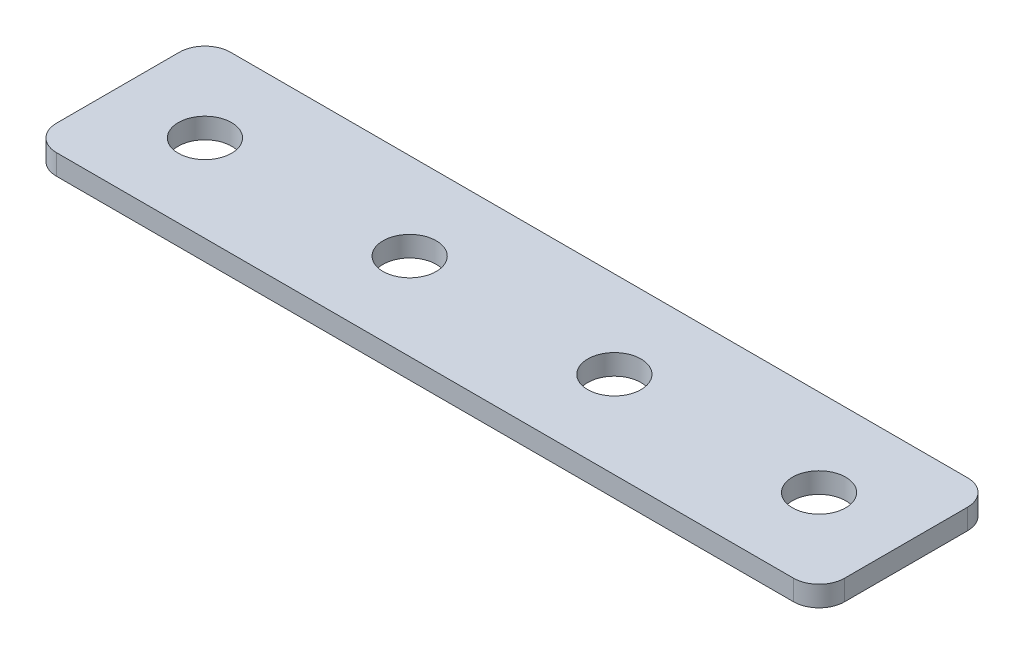
ISO-10303-21;
HEADER;
FILE_DESCRIPTION(('STEP AP214'),'2;1');
FILE_NAME('part.step','',(''),(''),'','','');
FILE_SCHEMA(('AUTOMOTIVE_DESIGN { 1 0 10303 214 1 1 1 1 }'));
ENDSEC;
DATA;
#1=APPLICATION_CONTEXT('core data for automotive mechanical design processes');
#2=APPLICATION_PROTOCOL_DEFINITION('international standard','automotive_design',2000,#1);
#3=PRODUCT_CONTEXT('',#1,'mechanical');
#4=PRODUCT('Part','Part','',(#3));
#5=PRODUCT_RELATED_PRODUCT_CATEGORY('part','',(#4));
#6=PRODUCT_DEFINITION_FORMATION('','',#4);
#7=PRODUCT_DEFINITION_CONTEXT('part definition',#1,'design');
#8=PRODUCT_DEFINITION('design','',#6,#7);
#9=PRODUCT_DEFINITION_SHAPE('','',#8);
#10=(LENGTH_UNIT() NAMED_UNIT(*) SI_UNIT(.MILLI.,.METRE.));
#11=(NAMED_UNIT(*) PLANE_ANGLE_UNIT() SI_UNIT($,.RADIAN.));
#12=(NAMED_UNIT(*) SI_UNIT($,.STERADIAN.) SOLID_ANGLE_UNIT());
#13=UNCERTAINTY_MEASURE_WITH_UNIT(LENGTH_MEASURE(1.E-05),#10,'distance_accuracy_value','');
#14=(GEOMETRIC_REPRESENTATION_CONTEXT(3) GLOBAL_UNCERTAINTY_ASSIGNED_CONTEXT((#13)) GLOBAL_UNIT_ASSIGNED_CONTEXT((#10,
#11,#12)) REPRESENTATION_CONTEXT('',''));
#15=CARTESIAN_POINT('',(0.,0.,0.));
#16=DIRECTION('',(0.,0.,1.));
#17=DIRECTION('',(1.,0.,0.));
#18=AXIS2_PLACEMENT_3D('',#15,#16,#17);
#19=CARTESIAN_POINT('',(-31.9370240083276,1.92462627726309,-0.98712697382552));
#20=DIRECTION('',(0.,-1.,0.));
#21=DIRECTION('',(0.,0.,-1.));
#22=AXIS2_PLACEMENT_3D('',#19,#20,#21);
#23=PLANE('',#22);
#24=CARTESIAN_POINT('',(28.0629759916724,1.92462627726309,-0.98712697382552));
#25=DIRECTION('',(0.,1.,0.));
#26=DIRECTION('',(0.,0.,1.));
#27=AXIS2_PLACEMENT_3D('',#24,#25,#26);
#28=CIRCLE('',#27,2.6);
#29=CARTESIAN_POINT('',(28.0629759916724,1.92462627726309,1.61287302617448));
#30=VERTEX_POINT('',#29);
#31=EDGE_CURVE('E169',#30,#30,#28,.T.);
#32=ORIENTED_EDGE('',*,*,#31,.T.);
#33=EDGE_LOOP('',(#32));
#34=FACE_BOUND('',#33,.T.);
#35=CARTESIAN_POINT('',(8.06297599167245,1.92462627726309,-0.98712697382552));
#36=DIRECTION('',(0.,1.,0.));
#37=DIRECTION('',(0.,0.,1.));
#38=AXIS2_PLACEMENT_3D('',#35,#36,#37);
#39=CIRCLE('',#38,2.6);
#40=CARTESIAN_POINT('',(8.06297599167245,1.92462627726309,1.61287302617448));
#41=VERTEX_POINT('',#40);
#42=EDGE_CURVE('E163',#41,#41,#39,.T.);
#43=ORIENTED_EDGE('',*,*,#42,.T.);
#44=EDGE_LOOP('',(#43));
#45=FACE_BOUND('',#44,.T.);
#46=CARTESIAN_POINT('',(-11.9370240083276,1.92462627726309,-0.987126973825509));
#47=DIRECTION('',(0.,1.,0.));
#48=DIRECTION('',(0.,0.,1.));
#49=AXIS2_PLACEMENT_3D('',#46,#47,#48);
#50=CIRCLE('',#49,2.6);
#51=CARTESIAN_POINT('',(-11.9370240083276,1.92462627726309,1.61287302617449));
#52=VERTEX_POINT('',#51);
#53=EDGE_CURVE('E157',#52,#52,#50,.T.);
#54=ORIENTED_EDGE('',*,*,#53,.T.);
#55=EDGE_LOOP('',(#54));
#56=FACE_BOUND('',#55,.T.);
#57=CARTESIAN_POINT('',(-31.9370240083276,1.92462627726309,-0.98712697382552));
#58=DIRECTION('',(0.,1.,0.));
#59=DIRECTION('',(0.,0.,1.));
#60=AXIS2_PLACEMENT_3D('',#57,#58,#59);
#61=CIRCLE('',#60,2.6);
#62=CARTESIAN_POINT('',(-31.9370240083276,1.92462627726309,1.61287302617448));
#63=VERTEX_POINT('',#62);
#64=EDGE_CURVE('E103',#63,#63,#61,.T.);
#65=ORIENTED_EDGE('',*,*,#64,.T.);
#66=EDGE_LOOP('',(#65));
#67=FACE_BOUND('',#66,.T.);
#68=DIRECTION('',(0.,0.,-1.));
#69=VECTOR('',#68,1.);
#70=CARTESIAN_POINT('',(36.5629759916724,1.92462627726309,7.51287302617452));
#71=LINE('',#70,#69);
#72=CARTESIAN_POINT('',(36.5629759916724,1.92462627726309,5.01287302617452));
#73=VERTEX_POINT('',#72);
#74=CARTESIAN_POINT('',(36.5629759916724,1.92462627726309,-6.98712697382557));
#75=VERTEX_POINT('',#74);
#76=EDGE_CURVE('E150',#73,#75,#71,.T.);
#77=ORIENTED_EDGE('',*,*,#76,.F.);
#78=CARTESIAN_POINT('',(34.0629759916724,1.92462627726309,5.01287302617452));
#79=DIRECTION('',(0.,-1.,0.));
#80=DIRECTION('',(0.,0.,-1.));
#81=AXIS2_PLACEMENT_3D('',#78,#79,#80);
#82=CIRCLE('',#81,2.5);
#83=CARTESIAN_POINT('',(34.0629759916724,1.92462627726309,7.51287302617452));
#84=VERTEX_POINT('',#83);
#85=EDGE_CURVE('E130',#73,#84,#82,.T.);
#86=ORIENTED_EDGE('',*,*,#85,.T.);
#87=DIRECTION('',(1.,0.,0.));
#88=VECTOR('',#87,1.);
#89=CARTESIAN_POINT('',(-23.4370240083275,1.92462627726309,7.51287302617452));
#90=LINE('',#89,#88);
#91=CARTESIAN_POINT('',(-37.9370240083276,1.92462627726309,7.51287302617452));
#92=VERTEX_POINT('',#91);
#93=EDGE_CURVE('E146',#92,#84,#90,.T.);
#94=ORIENTED_EDGE('',*,*,#93,.F.);
#95=CARTESIAN_POINT('',(-37.9370240083276,1.92462627726309,5.01287302617452));
#96=DIRECTION('',(0.,-1.,0.));
#97=DIRECTION('',(0.,0.,-1.));
#98=AXIS2_PLACEMENT_3D('',#95,#96,#97);
#99=CIRCLE('',#98,2.5);
#100=CARTESIAN_POINT('',(-40.4370240083276,1.92462627726309,5.01287302617452));
#101=VERTEX_POINT('',#100);
#102=EDGE_CURVE('E106',#92,#101,#99,.T.);
#103=ORIENTED_EDGE('',*,*,#102,.T.);
#104=DIRECTION('',(0.,0.,1.));
#105=VECTOR('',#104,1.);
#106=CARTESIAN_POINT('',(-40.4370240083276,1.92462627726309,-9.48712697382556));
#107=LINE('',#106,#105);
#108=CARTESIAN_POINT('',(-40.4370240083276,1.92462627726309,-6.98712697382556));
#109=VERTEX_POINT('',#108);
#110=EDGE_CURVE('E107',#109,#101,#107,.T.);
#111=ORIENTED_EDGE('',*,*,#110,.F.);
#112=CARTESIAN_POINT('',(-37.9370240083276,1.92462627726309,-6.98712697382556));
#113=DIRECTION('',(0.,-1.,0.));
#114=DIRECTION('',(0.,0.,-1.));
#115=AXIS2_PLACEMENT_3D('',#112,#113,#114);
#116=CIRCLE('',#115,2.5);
#117=CARTESIAN_POINT('',(-37.9370240083276,1.92462627726309,-9.48712697382556));
#118=VERTEX_POINT('',#117);
#119=EDGE_CURVE('E31',#109,#118,#116,.T.);
#120=ORIENTED_EDGE('',*,*,#119,.T.);
#121=DIRECTION('',(-1.,0.,0.));
#122=VECTOR('',#121,1.);
#123=CARTESIAN_POINT('',(36.5629759916724,1.92462627726309,-9.48712697382557));
#124=LINE('',#123,#122);
#125=CARTESIAN_POINT('',(34.0629759916724,1.92462627726309,-9.48712697382557));
#126=VERTEX_POINT('',#125);
#127=EDGE_CURVE('E111',#126,#118,#124,.T.);
#128=ORIENTED_EDGE('',*,*,#127,.F.);
#129=CARTESIAN_POINT('',(34.0629759916724,1.92462627726309,-6.98712697382557));
#130=DIRECTION('',(0.,-1.,0.));
#131=DIRECTION('',(0.,0.,-1.));
#132=AXIS2_PLACEMENT_3D('',#129,#130,#131);
#133=CIRCLE('',#132,2.5);
#134=EDGE_CURVE('E128',#126,#75,#133,.T.);
#135=ORIENTED_EDGE('',*,*,#134,.T.);
#136=EDGE_LOOP('',(#77,#86,#94,#103,#111,#120,#128,#135));
#137=FACE_BOUND('',#136,.T.);
#138=ADVANCED_FACE('F16',(#34,#45,#56,#67,#137),#23,.T.);
#139=CARTESIAN_POINT('',(-23.4370240083275,1.92462627726309,7.51287302617452));
#140=DIRECTION('',(0.,0.,1.));
#141=DIRECTION('',(1.,0.,0.));
#142=AXIS2_PLACEMENT_3D('',#139,#140,#141);
#143=PLANE('',#142);
#144=ORIENTED_EDGE('',*,*,#93,.T.);
#145=DIRECTION('',(0.,1.,0.));
#146=VECTOR('',#145,1.);
#147=CARTESIAN_POINT('',(34.0629759916724,1.92462627726309,7.51287302617452));
#148=LINE('',#147,#146);
#149=CARTESIAN_POINT('',(34.0629759916724,3.92462627726309,7.51287302617452));
#150=VERTEX_POINT('',#149);
#151=EDGE_CURVE('E93',#84,#150,#148,.T.);
#152=ORIENTED_EDGE('',*,*,#151,.T.);
#153=DIRECTION('',(1.,0.,0.));
#154=VECTOR('',#153,1.);
#155=CARTESIAN_POINT('',(-23.4370240083275,3.92462627726309,7.51287302617452));
#156=LINE('',#155,#154);
#157=CARTESIAN_POINT('',(-37.9370240083276,3.92462627726309,7.51287302617452));
#158=VERTEX_POINT('',#157);
#159=EDGE_CURVE('E85',#158,#150,#156,.T.);
#160=ORIENTED_EDGE('',*,*,#159,.F.);
#161=DIRECTION('',(0.,1.,0.));
#162=VECTOR('',#161,1.);
#163=CARTESIAN_POINT('',(-37.9370240083276,1.92462627726309,7.51287302617452));
#164=LINE('',#163,#162);
#165=EDGE_CURVE('E99',#158,#92,#164,.F.);
#166=ORIENTED_EDGE('',*,*,#165,.T.);
#167=EDGE_LOOP('',(#144,#152,#160,#166));
#168=FACE_BOUND('',#167,.T.);
#169=ADVANCED_FACE('F98',(#168),#143,.T.);
#170=CARTESIAN_POINT('',(-40.4370240083276,1.92462627726309,-9.48712697382556));
#171=DIRECTION('',(-1.,0.,0.));
#172=DIRECTION('',(0.,0.,1.));
#173=AXIS2_PLACEMENT_3D('',#170,#171,#172);
#174=PLANE('',#173);
#175=DIRECTION('',(0.,0.,1.));
#176=VECTOR('',#175,1.);
#177=CARTESIAN_POINT('',(-40.4370240083276,3.92462627726309,-9.48712697382556));
#178=LINE('',#177,#176);
#179=CARTESIAN_POINT('',(-40.4370240083276,3.92462627726309,-6.98712697382556));
#180=VERTEX_POINT('',#179);
#181=CARTESIAN_POINT('',(-40.4370240083276,3.92462627726309,5.01287302617452));
#182=VERTEX_POINT('',#181);
#183=EDGE_CURVE('E87',#180,#182,#178,.T.);
#184=ORIENTED_EDGE('',*,*,#183,.F.);
#185=DIRECTION('',(0.,1.,0.));
#186=VECTOR('',#185,1.);
#187=CARTESIAN_POINT('',(-40.4370240083276,1.92462627726309,-6.98712697382556));
#188=LINE('',#187,#186);
#189=EDGE_CURVE('E10',#180,#109,#188,.F.);
#190=ORIENTED_EDGE('',*,*,#189,.T.);
#191=ORIENTED_EDGE('',*,*,#110,.T.);
#192=DIRECTION('',(0.,1.,0.));
#193=VECTOR('',#192,1.);
#194=CARTESIAN_POINT('',(-40.4370240083276,1.92462627726309,5.01287302617452));
#195=LINE('',#194,#193);
#196=EDGE_CURVE('E24',#101,#182,#195,.T.);
#197=ORIENTED_EDGE('',*,*,#196,.T.);
#198=EDGE_LOOP('',(#184,#190,#191,#197));
#199=FACE_BOUND('',#198,.T.);
#200=ADVANCED_FACE('F136',(#199),#174,.T.);
#201=CARTESIAN_POINT('',(36.5629759916724,1.92462627726309,-9.48712697382557));
#202=DIRECTION('',(0.,0.,-1.));
#203=DIRECTION('',(-1.,0.,0.));
#204=AXIS2_PLACEMENT_3D('',#201,#202,#203);
#205=PLANE('',#204);
#206=DIRECTION('',(-1.,0.,0.));
#207=VECTOR('',#206,1.);
#208=CARTESIAN_POINT('',(36.5629759916724,3.92462627726309,-9.48712697382557));
#209=LINE('',#208,#207);
#210=CARTESIAN_POINT('',(34.0629759916724,3.92462627726309,-9.48712697382557));
#211=VERTEX_POINT('',#210);
#212=CARTESIAN_POINT('',(-37.9370240083276,3.92462627726309,-9.48712697382556));
#213=VERTEX_POINT('',#212);
#214=EDGE_CURVE('E144',#211,#213,#209,.T.);
#215=ORIENTED_EDGE('',*,*,#214,.F.);
#216=DIRECTION('',(0.,1.,0.));
#217=VECTOR('',#216,1.);
#218=CARTESIAN_POINT('',(34.0629759916724,1.92462627726309,-9.48712697382557));
#219=LINE('',#218,#217);
#220=EDGE_CURVE('E38',#211,#126,#219,.F.);
#221=ORIENTED_EDGE('',*,*,#220,.T.);
#222=ORIENTED_EDGE('',*,*,#127,.T.);
#223=DIRECTION('',(0.,1.,0.));
#224=VECTOR('',#223,1.);
#225=CARTESIAN_POINT('',(-37.9370240083276,1.92462627726309,-9.48712697382556));
#226=LINE('',#225,#224);
#227=EDGE_CURVE('E132',#118,#213,#226,.T.);
#228=ORIENTED_EDGE('',*,*,#227,.T.);
#229=EDGE_LOOP('',(#215,#221,#222,#228));
#230=FACE_BOUND('',#229,.T.);
#231=ADVANCED_FACE('F143',(#230),#205,.T.);
#232=CARTESIAN_POINT('',(36.5629759916724,1.92462627726309,7.51287302617452));
#233=DIRECTION('',(1.,0.,0.));
#234=DIRECTION('',(0.,0.,-1.));
#235=AXIS2_PLACEMENT_3D('',#232,#233,#234);
#236=PLANE('',#235);
#237=DIRECTION('',(0.,0.,-1.));
#238=VECTOR('',#237,1.);
#239=CARTESIAN_POINT('',(36.5629759916724,3.92462627726309,7.51287302617452));
#240=LINE('',#239,#238);
#241=CARTESIAN_POINT('',(36.5629759916724,3.92462627726309,5.01287302617452));
#242=VERTEX_POINT('',#241);
#243=CARTESIAN_POINT('',(36.5629759916724,3.92462627726309,-6.98712697382557));
#244=VERTEX_POINT('',#243);
#245=EDGE_CURVE('E102',#242,#244,#240,.T.);
#246=ORIENTED_EDGE('',*,*,#245,.F.);
#247=DIRECTION('',(0.,1.,0.));
#248=VECTOR('',#247,1.);
#249=CARTESIAN_POINT('',(36.5629759916724,1.92462627726309,5.01287302617452));
#250=LINE('',#249,#248);
#251=EDGE_CURVE('E124',#242,#73,#250,.F.);
#252=ORIENTED_EDGE('',*,*,#251,.T.);
#253=ORIENTED_EDGE('',*,*,#76,.T.);
#254=DIRECTION('',(0.,1.,0.));
#255=VECTOR('',#254,1.);
#256=CARTESIAN_POINT('',(36.5629759916724,1.92462627726309,-6.98712697382557));
#257=LINE('',#256,#255);
#258=EDGE_CURVE('E121',#75,#244,#257,.T.);
#259=ORIENTED_EDGE('',*,*,#258,.T.);
#260=EDGE_LOOP('',(#246,#252,#253,#259));
#261=FACE_BOUND('',#260,.T.);
#262=ADVANCED_FACE('F191',(#261),#236,.T.);
#263=CARTESIAN_POINT('',(-31.9370240083276,3.92462627726309,-0.98712697382552));
#264=DIRECTION('',(0.,-1.,0.));
#265=DIRECTION('',(0.,0.,-1.));
#266=AXIS2_PLACEMENT_3D('',#263,#264,#265);
#267=PLANE('',#266);
#268=CARTESIAN_POINT('',(28.0629759916724,3.92462627726309,-0.98712697382552));
#269=DIRECTION('',(0.,1.,0.));
#270=DIRECTION('',(0.,0.,1.));
#271=AXIS2_PLACEMENT_3D('',#268,#269,#270);
#272=CIRCLE('',#271,2.6);
#273=CARTESIAN_POINT('',(28.0629759916724,3.92462627726309,1.61287302617448));
#274=VERTEX_POINT('',#273);
#275=EDGE_CURVE('E172',#274,#274,#272,.T.);
#276=ORIENTED_EDGE('',*,*,#275,.F.);
#277=EDGE_LOOP('',(#276));
#278=FACE_BOUND('',#277,.T.);
#279=CARTESIAN_POINT('',(8.06297599167245,3.92462627726309,-0.98712697382552));
#280=DIRECTION('',(0.,1.,0.));
#281=DIRECTION('',(0.,0.,1.));
#282=AXIS2_PLACEMENT_3D('',#279,#280,#281);
#283=CIRCLE('',#282,2.6);
#284=CARTESIAN_POINT('',(8.06297599167245,3.92462627726309,1.61287302617448));
#285=VERTEX_POINT('',#284);
#286=EDGE_CURVE('E166',#285,#285,#283,.T.);
#287=ORIENTED_EDGE('',*,*,#286,.F.);
#288=EDGE_LOOP('',(#287));
#289=FACE_BOUND('',#288,.T.);
#290=CARTESIAN_POINT('',(-11.9370240083276,3.92462627726309,-0.987126973825509));
#291=DIRECTION('',(0.,1.,0.));
#292=DIRECTION('',(0.,0.,1.));
#293=AXIS2_PLACEMENT_3D('',#290,#291,#292);
#294=CIRCLE('',#293,2.6);
#295=CARTESIAN_POINT('',(-11.9370240083276,3.92462627726309,1.61287302617449));
#296=VERTEX_POINT('',#295);
#297=EDGE_CURVE('E160',#296,#296,#294,.T.);
#298=ORIENTED_EDGE('',*,*,#297,.F.);
#299=EDGE_LOOP('',(#298));
#300=FACE_BOUND('',#299,.T.);
#301=CARTESIAN_POINT('',(-31.9370240083276,3.92462627726309,-0.98712697382552));
#302=DIRECTION('',(0.,1.,0.));
#303=DIRECTION('',(0.,0.,1.));
#304=AXIS2_PLACEMENT_3D('',#301,#302,#303);
#305=CIRCLE('',#304,2.6);
#306=CARTESIAN_POINT('',(-31.9370240083276,3.92462627726309,1.61287302617448));
#307=VERTEX_POINT('',#306);
#308=EDGE_CURVE('E154',#307,#307,#305,.T.);
#309=ORIENTED_EDGE('',*,*,#308,.F.);
#310=EDGE_LOOP('',(#309));
#311=FACE_BOUND('',#310,.T.);
#312=ORIENTED_EDGE('',*,*,#159,.T.);
#313=CARTESIAN_POINT('',(34.0629759916724,3.92462627726309,5.01287302617452));
#314=DIRECTION('',(0.,-1.,0.));
#315=DIRECTION('',(0.,0.,-1.));
#316=AXIS2_PLACEMENT_3D('',#313,#314,#315);
#317=CIRCLE('',#316,2.5);
#318=EDGE_CURVE('E119',#150,#242,#317,.F.);
#319=ORIENTED_EDGE('',*,*,#318,.T.);
#320=ORIENTED_EDGE('',*,*,#245,.T.);
#321=CARTESIAN_POINT('',(34.0629759916724,3.92462627726309,-6.98712697382557));
#322=DIRECTION('',(0.,-1.,0.));
#323=DIRECTION('',(0.,0.,-1.));
#324=AXIS2_PLACEMENT_3D('',#321,#322,#323);
#325=CIRCLE('',#324,2.5);
#326=EDGE_CURVE('E117',#244,#211,#325,.F.);
#327=ORIENTED_EDGE('',*,*,#326,.T.);
#328=ORIENTED_EDGE('',*,*,#214,.T.);
#329=CARTESIAN_POINT('',(-37.9370240083276,3.92462627726309,-6.98712697382556));
#330=DIRECTION('',(0.,-1.,0.));
#331=DIRECTION('',(0.,0.,-1.));
#332=AXIS2_PLACEMENT_3D('',#329,#330,#331);
#333=CIRCLE('',#332,2.5);
#334=EDGE_CURVE('E92',#213,#180,#333,.F.);
#335=ORIENTED_EDGE('',*,*,#334,.T.);
#336=ORIENTED_EDGE('',*,*,#183,.T.);
#337=CARTESIAN_POINT('',(-37.9370240083276,3.92462627726309,5.01287302617452));
#338=DIRECTION('',(0.,-1.,0.));
#339=DIRECTION('',(0.,0.,-1.));
#340=AXIS2_PLACEMENT_3D('',#337,#338,#339);
#341=CIRCLE('',#340,2.5);
#342=EDGE_CURVE('E82',#182,#158,#341,.F.);
#343=ORIENTED_EDGE('',*,*,#342,.T.);
#344=EDGE_LOOP('',(#312,#319,#320,#327,#328,#335,#336,#343));
#345=FACE_BOUND('',#344,.T.);
#346=ADVANCED_FACE('F84',(#278,#289,#300,#311,#345),#267,.F.);
#347=CARTESIAN_POINT('',(-31.9370240083276,1.92462627726309,-0.98712697382552));
#348=DIRECTION('',(0.,1.,0.));
#349=DIRECTION('',(0.,0.,1.));
#350=AXIS2_PLACEMENT_3D('',#347,#348,#349);
#351=CYLINDRICAL_SURFACE('',#350,2.6);
#352=ORIENTED_EDGE('',*,*,#64,.F.);
#353=EDGE_LOOP('',(#352));
#354=FACE_BOUND('',#353,.T.);
#355=ORIENTED_EDGE('',*,*,#308,.T.);
#356=EDGE_LOOP('',(#355));
#357=FACE_BOUND('',#356,.T.);
#358=ADVANCED_FACE('F190',(#354,#357),#351,.F.);
#359=CARTESIAN_POINT('',(-11.9370240083276,1.92462627726309,-0.987126973825509));
#360=DIRECTION('',(0.,1.,0.));
#361=DIRECTION('',(0.,0.,1.));
#362=AXIS2_PLACEMENT_3D('',#359,#360,#361);
#363=CYLINDRICAL_SURFACE('',#362,2.6);
#364=ORIENTED_EDGE('',*,*,#53,.F.);
#365=EDGE_LOOP('',(#364));
#366=FACE_BOUND('',#365,.T.);
#367=ORIENTED_EDGE('',*,*,#297,.T.);
#368=EDGE_LOOP('',(#367));
#369=FACE_BOUND('',#368,.T.);
#370=ADVANCED_FACE('F200',(#366,#369),#363,.F.);
#371=CARTESIAN_POINT('',(8.06297599167245,1.92462627726309,-0.98712697382552));
#372=DIRECTION('',(0.,1.,0.));
#373=DIRECTION('',(0.,0.,1.));
#374=AXIS2_PLACEMENT_3D('',#371,#372,#373);
#375=CYLINDRICAL_SURFACE('',#374,2.6);
#376=ORIENTED_EDGE('',*,*,#42,.F.);
#377=EDGE_LOOP('',(#376));
#378=FACE_BOUND('',#377,.T.);
#379=ORIENTED_EDGE('',*,*,#286,.T.);
#380=EDGE_LOOP('',(#379));
#381=FACE_BOUND('',#380,.T.);
#382=ADVANCED_FACE('F184',(#378,#381),#375,.F.);
#383=CARTESIAN_POINT('',(28.0629759916724,1.92462627726309,-0.98712697382552));
#384=DIRECTION('',(0.,1.,0.));
#385=DIRECTION('',(0.,0.,1.));
#386=AXIS2_PLACEMENT_3D('',#383,#384,#385);
#387=CYLINDRICAL_SURFACE('',#386,2.6);
#388=ORIENTED_EDGE('',*,*,#31,.F.);
#389=EDGE_LOOP('',(#388));
#390=FACE_BOUND('',#389,.T.);
#391=ORIENTED_EDGE('',*,*,#275,.T.);
#392=EDGE_LOOP('',(#391));
#393=FACE_BOUND('',#392,.T.);
#394=ADVANCED_FACE('F180',(#390,#393),#387,.F.);
#395=CARTESIAN_POINT('',(34.0629759916724,1.92462627726309,5.01287302617452));
#396=DIRECTION('',(0.,1.,0.));
#397=DIRECTION('',(0.,0.,1.));
#398=AXIS2_PLACEMENT_3D('',#395,#396,#397);
#399=CYLINDRICAL_SURFACE('',#398,2.5);
#400=ORIENTED_EDGE('',*,*,#85,.F.);
#401=ORIENTED_EDGE('',*,*,#251,.F.);
#402=ORIENTED_EDGE('',*,*,#318,.F.);
#403=ORIENTED_EDGE('',*,*,#151,.F.);
#404=EDGE_LOOP('',(#400,#401,#402,#403));
#405=FACE_BOUND('',#404,.T.);
#406=ADVANCED_FACE('F183',(#405),#399,.T.);
#407=CARTESIAN_POINT('',(34.0629759916724,1.92462627726309,-6.98712697382557));
#408=DIRECTION('',(0.,1.,0.));
#409=DIRECTION('',(0.,0.,1.));
#410=AXIS2_PLACEMENT_3D('',#407,#408,#409);
#411=CYLINDRICAL_SURFACE('',#410,2.5);
#412=ORIENTED_EDGE('',*,*,#134,.F.);
#413=ORIENTED_EDGE('',*,*,#220,.F.);
#414=ORIENTED_EDGE('',*,*,#326,.F.);
#415=ORIENTED_EDGE('',*,*,#258,.F.);
#416=EDGE_LOOP('',(#412,#413,#414,#415));
#417=FACE_BOUND('',#416,.T.);
#418=ADVANCED_FACE('F220',(#417),#411,.T.);
#419=CARTESIAN_POINT('',(-37.9370240083276,1.92462627726309,-6.98712697382556));
#420=DIRECTION('',(0.,1.,0.));
#421=DIRECTION('',(0.,0.,1.));
#422=AXIS2_PLACEMENT_3D('',#419,#420,#421);
#423=CYLINDRICAL_SURFACE('',#422,2.5);
#424=ORIENTED_EDGE('',*,*,#119,.F.);
#425=ORIENTED_EDGE('',*,*,#189,.F.);
#426=ORIENTED_EDGE('',*,*,#334,.F.);
#427=ORIENTED_EDGE('',*,*,#227,.F.);
#428=EDGE_LOOP('',(#424,#425,#426,#427));
#429=FACE_BOUND('',#428,.T.);
#430=ADVANCED_FACE('F141',(#429),#423,.T.);
#431=CARTESIAN_POINT('',(-37.9370240083276,1.92462627726309,5.01287302617452));
#432=DIRECTION('',(0.,1.,0.));
#433=DIRECTION('',(0.,0.,1.));
#434=AXIS2_PLACEMENT_3D('',#431,#432,#433);
#435=CYLINDRICAL_SURFACE('',#434,2.5);
#436=ORIENTED_EDGE('',*,*,#102,.F.);
#437=ORIENTED_EDGE('',*,*,#165,.F.);
#438=ORIENTED_EDGE('',*,*,#342,.F.);
#439=ORIENTED_EDGE('',*,*,#196,.F.);
#440=EDGE_LOOP('',(#436,#437,#438,#439));
#441=FACE_BOUND('',#440,.T.);
#442=ADVANCED_FACE('F18',(#441),#435,.T.);
#443=CLOSED_SHELL('',(#138,#169,#200,#231,#262,#346,#358,#370,#382,#394,#406,#418,#430,#442));
#444=MANIFOLD_SOLID_BREP('B1',#443);
#445=ADVANCED_BREP_SHAPE_REPRESENTATION('',(#18,#444),#14);
#446=SHAPE_DEFINITION_REPRESENTATION(#9,#445);
ENDSEC;
END-ISO-10303-21;
